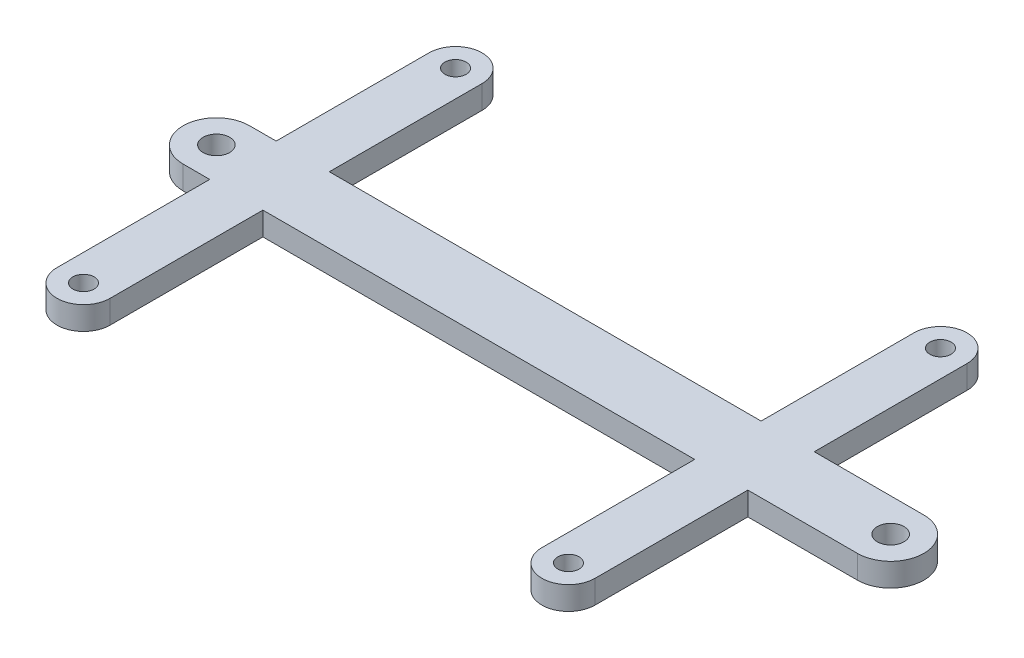
ISO-10303-21;
HEADER;
FILE_DESCRIPTION(('STEP AP214'),'2;1');
FILE_NAME('part.step','',(''),(''),'','','');
FILE_SCHEMA(('AUTOMOTIVE_DESIGN { 1 0 10303 214 1 1 1 1 }'));
ENDSEC;
DATA;
#1=APPLICATION_CONTEXT('core data for automotive mechanical design processes');
#2=APPLICATION_PROTOCOL_DEFINITION('international standard','automotive_design',2000,#1);
#3=PRODUCT_CONTEXT('',#1,'mechanical');
#4=PRODUCT('Part','Part','',(#3));
#5=PRODUCT_RELATED_PRODUCT_CATEGORY('part','',(#4));
#6=PRODUCT_DEFINITION_FORMATION('','',#4);
#7=PRODUCT_DEFINITION_CONTEXT('part definition',#1,'design');
#8=PRODUCT_DEFINITION('design','',#6,#7);
#9=PRODUCT_DEFINITION_SHAPE('','',#8);
#10=(LENGTH_UNIT() NAMED_UNIT(*) SI_UNIT(.MILLI.,.METRE.));
#11=(NAMED_UNIT(*) PLANE_ANGLE_UNIT() SI_UNIT($,.RADIAN.));
#12=(NAMED_UNIT(*) SI_UNIT($,.STERADIAN.) SOLID_ANGLE_UNIT());
#13=UNCERTAINTY_MEASURE_WITH_UNIT(LENGTH_MEASURE(1.E-05),#10,'distance_accuracy_value','');
#14=(GEOMETRIC_REPRESENTATION_CONTEXT(3) GLOBAL_UNCERTAINTY_ASSIGNED_CONTEXT((#13)) GLOBAL_UNIT_ASSIGNED_CONTEXT((#10,
#11,#12)) REPRESENTATION_CONTEXT('',''));
#15=CARTESIAN_POINT('',(0.,0.,0.));
#16=DIRECTION('',(0.,0.,1.));
#17=DIRECTION('',(1.,0.,0.));
#18=AXIS2_PLACEMENT_3D('',#15,#16,#17);
#19=CARTESIAN_POINT('',(29.5,3.5,27.9999999999974));
#20=DIRECTION('',(0.,-1.,0.));
#21=DIRECTION('',(0.,0.,-1.));
#22=AXIS2_PLACEMENT_3D('',#19,#20,#21);
#23=CYLINDRICAL_SURFACE('',#22,4.);
#24=CARTESIAN_POINT('',(29.5,0.,27.9999999999974));
#25=DIRECTION('',(0.,1.,0.));
#26=DIRECTION('',(0.,0.,1.));
#27=AXIS2_PLACEMENT_3D('',#24,#25,#26);
#28=CIRCLE('',#27,4.);
#29=CARTESIAN_POINT('',(33.5,0.,27.9999999999974));
#30=VERTEX_POINT('',#29);
#31=CARTESIAN_POINT('',(25.5,0.,27.9999999999974));
#32=VERTEX_POINT('',#31);
#33=EDGE_CURVE('E249',#30,#32,#28,.F.);
#34=ORIENTED_EDGE('',*,*,#33,.F.);
#35=DIRECTION('',(0.,-1.,0.));
#36=VECTOR('',#35,1.);
#37=CARTESIAN_POINT('',(33.5,3.5,27.9999999999974));
#38=LINE('',#37,#36);
#39=CARTESIAN_POINT('',(33.5,3.5,27.9999999999974));
#40=VERTEX_POINT('',#39);
#41=EDGE_CURVE('E11',#40,#30,#38,.T.);
#42=ORIENTED_EDGE('',*,*,#41,.F.);
#43=CARTESIAN_POINT('',(29.5,3.5,27.9999999999974));
#44=DIRECTION('',(0.,1.,0.));
#45=DIRECTION('',(0.,0.,1.));
#46=AXIS2_PLACEMENT_3D('',#43,#44,#45);
#47=CIRCLE('',#46,4.);
#48=CARTESIAN_POINT('',(25.5,3.5,27.9999999999974));
#49=VERTEX_POINT('',#48);
#50=EDGE_CURVE('E615',#40,#49,#47,.F.);
#51=ORIENTED_EDGE('',*,*,#50,.T.);
#52=DIRECTION('',(0.,-1.,0.));
#53=VECTOR('',#52,1.);
#54=CARTESIAN_POINT('',(25.5,3.5,27.9999999999974));
#55=LINE('',#54,#53);
#56=EDGE_CURVE('E52',#49,#32,#55,.T.);
#57=ORIENTED_EDGE('',*,*,#56,.T.);
#58=EDGE_LOOP('',(#34,#42,#51,#57));
#59=FACE_BOUND('',#58,.T.);
#60=ADVANCED_FACE('F35',(#59),#23,.T.);
#61=CARTESIAN_POINT('',(33.5,3.5,0.));
#62=DIRECTION('',(-1.,0.,0.));
#63=DIRECTION('',(0.,0.,1.));
#64=AXIS2_PLACEMENT_3D('',#61,#62,#63);
#65=PLANE('',#64);
#66=DIRECTION('',(0.,0.,-1.));
#67=VECTOR('',#66,1.);
#68=CARTESIAN_POINT('',(33.5,0.,0.));
#69=LINE('',#68,#67);
#70=CARTESIAN_POINT('',(33.5,0.,5.00000000000078));
#71=VERTEX_POINT('',#70);
#72=EDGE_CURVE('E246',#30,#71,#69,.T.);
#73=ORIENTED_EDGE('',*,*,#72,.T.);
#74=DIRECTION('',(0.,-1.,0.));
#75=VECTOR('',#74,1.);
#76=CARTESIAN_POINT('',(33.5,3.5,5.00000000000078));
#77=LINE('',#76,#75);
#78=CARTESIAN_POINT('',(33.5,3.5,5.00000000000078));
#79=VERTEX_POINT('',#78);
#80=EDGE_CURVE('E44',#79,#71,#77,.T.);
#81=ORIENTED_EDGE('',*,*,#80,.F.);
#82=DIRECTION('',(0.,0.,-1.));
#83=VECTOR('',#82,1.);
#84=CARTESIAN_POINT('',(33.5,3.5,0.));
#85=LINE('',#84,#83);
#86=EDGE_CURVE('E613',#40,#79,#85,.T.);
#87=ORIENTED_EDGE('',*,*,#86,.F.);
#88=ORIENTED_EDGE('',*,*,#41,.T.);
#89=EDGE_LOOP('',(#73,#81,#87,#88));
#90=FACE_BOUND('',#89,.T.);
#91=ADVANCED_FACE('F247',(#90),#65,.F.);
#92=CARTESIAN_POINT('',(2.39181570172674E-13,3.5,5.00000000000238));
#93=DIRECTION('',(0.,0.,1.));
#94=DIRECTION('',(1.,0.,0.));
#95=AXIS2_PLACEMENT_3D('',#92,#93,#94);
#96=PLANE('',#95);
#97=DIRECTION('',(-1.,0.,0.));
#98=VECTOR('',#97,1.);
#99=CARTESIAN_POINT('',(2.39181570172674E-13,0.,5.00000000000238));
#100=LINE('',#99,#98);
#101=CARTESIAN_POINT('',(50.,0.,4.99999999999999));
#102=VERTEX_POINT('',#101);
#103=EDGE_CURVE('E241',#102,#71,#100,.T.);
#104=ORIENTED_EDGE('',*,*,#103,.F.);
#105=DIRECTION('',(0.,-1.,0.));
#106=VECTOR('',#105,1.);
#107=CARTESIAN_POINT('',(50.,3.5,4.99999999999999));
#108=LINE('',#107,#106);
#109=CARTESIAN_POINT('',(50.,3.5,4.99999999999999));
#110=VERTEX_POINT('',#109);
#111=EDGE_CURVE('E233',#110,#102,#108,.T.);
#112=ORIENTED_EDGE('',*,*,#111,.F.);
#113=DIRECTION('',(-1.,0.,0.));
#114=VECTOR('',#113,1.);
#115=CARTESIAN_POINT('',(2.39181570172674E-13,3.5,5.00000000000238));
#116=LINE('',#115,#114);
#117=EDGE_CURVE('E243',#110,#79,#116,.T.);
#118=ORIENTED_EDGE('',*,*,#117,.T.);
#119=ORIENTED_EDGE('',*,*,#80,.T.);
#120=EDGE_LOOP('',(#104,#112,#118,#119));
#121=FACE_BOUND('',#120,.T.);
#122=ADVANCED_FACE('F239',(#121),#96,.T.);
#123=CARTESIAN_POINT('',(50.,3.5,0.));
#124=DIRECTION('',(0.,-1.,0.));
#125=DIRECTION('',(0.,0.,-1.));
#126=AXIS2_PLACEMENT_3D('',#123,#124,#125);
#127=CYLINDRICAL_SURFACE('',#126,4.99999999999999);
#128=CARTESIAN_POINT('',(50.,0.,0.));
#129=DIRECTION('',(0.,1.,0.));
#130=DIRECTION('',(0.,0.,1.));
#131=AXIS2_PLACEMENT_3D('',#128,#129,#130);
#132=CIRCLE('',#131,4.99999999999999);
#133=CARTESIAN_POINT('',(50.,0.,-4.99999999999999));
#134=VERTEX_POINT('',#133);
#135=EDGE_CURVE('E255',#102,#134,#132,.T.);
#136=ORIENTED_EDGE('',*,*,#135,.T.);
#137=DIRECTION('',(0.,-1.,0.));
#138=VECTOR('',#137,1.);
#139=CARTESIAN_POINT('',(50.,3.5,-4.99999999999999));
#140=LINE('',#139,#138);
#141=CARTESIAN_POINT('',(50.,3.5,-4.99999999999999));
#142=VERTEX_POINT('',#141);
#143=EDGE_CURVE('E230',#142,#134,#140,.T.);
#144=ORIENTED_EDGE('',*,*,#143,.F.);
#145=CARTESIAN_POINT('',(50.,3.5,0.));
#146=DIRECTION('',(0.,1.,0.));
#147=DIRECTION('',(0.,0.,1.));
#148=AXIS2_PLACEMENT_3D('',#145,#146,#147);
#149=CIRCLE('',#148,4.99999999999999);
#150=EDGE_CURVE('E610',#110,#142,#149,.T.);
#151=ORIENTED_EDGE('',*,*,#150,.F.);
#152=ORIENTED_EDGE('',*,*,#111,.T.);
#153=EDGE_LOOP('',(#136,#144,#151,#152));
#154=FACE_BOUND('',#153,.T.);
#155=ADVANCED_FACE('F563',(#154),#127,.T.);
#156=CARTESIAN_POINT('',(2.39181570172674E-13,3.5,-5.00000000000238));
#157=DIRECTION('',(0.,0.,1.));
#158=DIRECTION('',(1.,0.,0.));
#159=AXIS2_PLACEMENT_3D('',#156,#157,#158);
#160=PLANE('',#159);
#161=DIRECTION('',(-1.,0.,0.));
#162=VECTOR('',#161,1.);
#163=CARTESIAN_POINT('',(2.39181570172674E-13,0.,-5.00000000000238));
#164=LINE('',#163,#162);
#165=CARTESIAN_POINT('',(33.5,0.,-5.00000000000078));
#166=VERTEX_POINT('',#165);
#167=EDGE_CURVE('E257',#134,#166,#164,.T.);
#168=ORIENTED_EDGE('',*,*,#167,.T.);
#169=DIRECTION('',(0.,-1.,0.));
#170=VECTOR('',#169,1.);
#171=CARTESIAN_POINT('',(33.5,3.5,-5.00000000000078));
#172=LINE('',#171,#170);
#173=CARTESIAN_POINT('',(33.5,3.5,-5.00000000000078));
#174=VERTEX_POINT('',#173);
#175=EDGE_CURVE('E228',#174,#166,#172,.T.);
#176=ORIENTED_EDGE('',*,*,#175,.F.);
#177=DIRECTION('',(-1.,0.,0.));
#178=VECTOR('',#177,1.);
#179=CARTESIAN_POINT('',(2.39181570172674E-13,3.5,-5.00000000000238));
#180=LINE('',#179,#178);
#181=EDGE_CURVE('E611',#142,#174,#180,.T.);
#182=ORIENTED_EDGE('',*,*,#181,.F.);
#183=ORIENTED_EDGE('',*,*,#143,.T.);
#184=EDGE_LOOP('',(#168,#176,#182,#183));
#185=FACE_BOUND('',#184,.T.);
#186=ADVANCED_FACE('F554',(#185),#160,.F.);
#187=CARTESIAN_POINT('',(33.5,3.5,0.));
#188=DIRECTION('',(1.,0.,0.));
#189=DIRECTION('',(0.,0.,-1.));
#190=AXIS2_PLACEMENT_3D('',#187,#188,#189);
#191=PLANE('',#190);
#192=DIRECTION('',(0.,0.,1.));
#193=VECTOR('',#192,1.);
#194=CARTESIAN_POINT('',(33.5,0.,0.));
#195=LINE('',#194,#193);
#196=CARTESIAN_POINT('',(33.5,0.,-27.9999999999974));
#197=VERTEX_POINT('',#196);
#198=EDGE_CURVE('E263',#197,#166,#195,.T.);
#199=ORIENTED_EDGE('',*,*,#198,.F.);
#200=DIRECTION('',(0.,-1.,0.));
#201=VECTOR('',#200,1.);
#202=CARTESIAN_POINT('',(33.5,3.5,-27.9999999999974));
#203=LINE('',#202,#201);
#204=CARTESIAN_POINT('',(33.5,3.5,-27.9999999999974));
#205=VERTEX_POINT('',#204);
#206=EDGE_CURVE('E226',#205,#197,#203,.T.);
#207=ORIENTED_EDGE('',*,*,#206,.F.);
#208=DIRECTION('',(0.,0.,1.));
#209=VECTOR('',#208,1.);
#210=CARTESIAN_POINT('',(33.5,3.5,0.));
#211=LINE('',#210,#209);
#212=EDGE_CURVE('E620',#205,#174,#211,.T.);
#213=ORIENTED_EDGE('',*,*,#212,.T.);
#214=ORIENTED_EDGE('',*,*,#175,.T.);
#215=EDGE_LOOP('',(#199,#207,#213,#214));
#216=FACE_BOUND('',#215,.T.);
#217=ADVANCED_FACE('F545',(#216),#191,.T.);
#218=CARTESIAN_POINT('',(29.5,3.5,-27.9999999999974));
#219=DIRECTION('',(0.,-1.,0.));
#220=DIRECTION('',(0.,0.,-1.));
#221=AXIS2_PLACEMENT_3D('',#218,#219,#220);
#222=CYLINDRICAL_SURFACE('',#221,4.);
#223=CARTESIAN_POINT('',(29.5,0.,-27.9999999999974));
#224=DIRECTION('',(0.,1.,0.));
#225=DIRECTION('',(0.,0.,1.));
#226=AXIS2_PLACEMENT_3D('',#223,#224,#225);
#227=CIRCLE('',#226,4.);
#228=CARTESIAN_POINT('',(25.5,0.,-27.9999999999974));
#229=VERTEX_POINT('',#228);
#230=EDGE_CURVE('E266',#197,#229,#227,.T.);
#231=ORIENTED_EDGE('',*,*,#230,.T.);
#232=DIRECTION('',(0.,-1.,0.));
#233=VECTOR('',#232,1.);
#234=CARTESIAN_POINT('',(25.5,3.5,-27.9999999999974));
#235=LINE('',#234,#233);
#236=CARTESIAN_POINT('',(25.5,3.5,-27.9999999999974));
#237=VERTEX_POINT('',#236);
#238=EDGE_CURVE('E223',#237,#229,#235,.T.);
#239=ORIENTED_EDGE('',*,*,#238,.F.);
#240=CARTESIAN_POINT('',(29.5,3.5,-27.9999999999974));
#241=DIRECTION('',(0.,1.,0.));
#242=DIRECTION('',(0.,0.,1.));
#243=AXIS2_PLACEMENT_3D('',#240,#241,#242);
#244=CIRCLE('',#243,4.);
#245=EDGE_CURVE('E623',#205,#237,#244,.T.);
#246=ORIENTED_EDGE('',*,*,#245,.F.);
#247=ORIENTED_EDGE('',*,*,#206,.T.);
#248=EDGE_LOOP('',(#231,#239,#246,#247));
#249=FACE_BOUND('',#248,.T.);
#250=ADVANCED_FACE('F536',(#249),#222,.T.);
#251=CARTESIAN_POINT('',(25.5,3.5,0.));
#252=DIRECTION('',(1.,0.,0.));
#253=DIRECTION('',(0.,0.,-1.));
#254=AXIS2_PLACEMENT_3D('',#251,#252,#253);
#255=PLANE('',#254);
#256=DIRECTION('',(0.,0.,1.));
#257=VECTOR('',#256,1.);
#258=CARTESIAN_POINT('',(25.5,0.,0.));
#259=LINE('',#258,#257);
#260=CARTESIAN_POINT('',(25.5,0.,-5.00000000000077));
#261=VERTEX_POINT('',#260);
#262=EDGE_CURVE('E269',#229,#261,#259,.T.);
#263=ORIENTED_EDGE('',*,*,#262,.T.);
#264=DIRECTION('',(0.,-1.,0.));
#265=VECTOR('',#264,1.);
#266=CARTESIAN_POINT('',(25.5,3.5,-5.00000000000077));
#267=LINE('',#266,#265);
#268=CARTESIAN_POINT('',(25.5,3.5,-5.00000000000077));
#269=VERTEX_POINT('',#268);
#270=EDGE_CURVE('E221',#269,#261,#267,.T.);
#271=ORIENTED_EDGE('',*,*,#270,.F.);
#272=DIRECTION('',(0.,0.,1.));
#273=VECTOR('',#272,1.);
#274=CARTESIAN_POINT('',(25.5,3.5,0.));
#275=LINE('',#274,#273);
#276=EDGE_CURVE('E626',#237,#269,#275,.T.);
#277=ORIENTED_EDGE('',*,*,#276,.F.);
#278=ORIENTED_EDGE('',*,*,#238,.T.);
#279=EDGE_LOOP('',(#263,#271,#277,#278));
#280=FACE_BOUND('',#279,.T.);
#281=ADVANCED_FACE('F527',(#280),#255,.F.);
#282=CARTESIAN_POINT('',(0.,3.5,-5.00000000000077));
#283=DIRECTION('',(0.,0.,-1.));
#284=DIRECTION('',(-1.,0.,0.));
#285=AXIS2_PLACEMENT_3D('',#282,#283,#284);
#286=PLANE('',#285);
#287=DIRECTION('',(1.,0.,0.));
#288=VECTOR('',#287,1.);
#289=CARTESIAN_POINT('',(0.,0.,-5.00000000000077));
#290=LINE('',#289,#288);
#291=CARTESIAN_POINT('',(-39.4999999999989,0.,-5.00000000000078));
#292=VERTEX_POINT('',#291);
#293=EDGE_CURVE('E272',#292,#261,#290,.T.);
#294=ORIENTED_EDGE('',*,*,#293,.F.);
#295=DIRECTION('',(0.,-1.,0.));
#296=VECTOR('',#295,1.);
#297=CARTESIAN_POINT('',(-39.4999999999989,3.5,-5.00000000000078));
#298=LINE('',#297,#296);
#299=CARTESIAN_POINT('',(-39.4999999999989,3.5,-5.00000000000078));
#300=VERTEX_POINT('',#299);
#301=EDGE_CURVE('E219',#300,#292,#298,.T.);
#302=ORIENTED_EDGE('',*,*,#301,.F.);
#303=DIRECTION('',(1.,0.,0.));
#304=VECTOR('',#303,1.);
#305=CARTESIAN_POINT('',(0.,3.5,-5.00000000000077));
#306=LINE('',#305,#304);
#307=EDGE_CURVE('E628',#300,#269,#306,.T.);
#308=ORIENTED_EDGE('',*,*,#307,.T.);
#309=ORIENTED_EDGE('',*,*,#270,.T.);
#310=EDGE_LOOP('',(#294,#302,#308,#309));
#311=FACE_BOUND('',#310,.T.);
#312=ADVANCED_FACE('F518',(#311),#286,.T.);
#313=CARTESIAN_POINT('',(-39.4999999999989,3.5,0.));
#314=DIRECTION('',(1.,0.,0.));
#315=DIRECTION('',(0.,0.,-1.));
#316=AXIS2_PLACEMENT_3D('',#313,#314,#315);
#317=PLANE('',#316);
#318=DIRECTION('',(0.,0.,1.));
#319=VECTOR('',#318,1.);
#320=CARTESIAN_POINT('',(-39.4999999999989,0.,0.));
#321=LINE('',#320,#319);
#322=CARTESIAN_POINT('',(-39.4999999999989,0.,-28.0000000000003));
#323=VERTEX_POINT('',#322);
#324=EDGE_CURVE('E275',#323,#292,#321,.T.);
#325=ORIENTED_EDGE('',*,*,#324,.F.);
#326=DIRECTION('',(0.,-1.,0.));
#327=VECTOR('',#326,1.);
#328=CARTESIAN_POINT('',(-39.4999999999989,3.5,-28.0000000000003));
#329=LINE('',#328,#327);
#330=CARTESIAN_POINT('',(-39.4999999999989,3.5,-28.0000000000003));
#331=VERTEX_POINT('',#330);
#332=EDGE_CURVE('E217',#331,#323,#329,.T.);
#333=ORIENTED_EDGE('',*,*,#332,.F.);
#334=DIRECTION('',(0.,0.,1.));
#335=VECTOR('',#334,1.);
#336=CARTESIAN_POINT('',(-39.4999999999989,3.5,0.));
#337=LINE('',#336,#335);
#338=EDGE_CURVE('E631',#331,#300,#337,.T.);
#339=ORIENTED_EDGE('',*,*,#338,.T.);
#340=ORIENTED_EDGE('',*,*,#301,.T.);
#341=EDGE_LOOP('',(#325,#333,#339,#340));
#342=FACE_BOUND('',#341,.T.);
#343=ADVANCED_FACE('F509',(#342),#317,.T.);
#344=CARTESIAN_POINT('',(-43.4999999999989,3.5,-28.0000000000003));
#345=DIRECTION('',(0.,-1.,0.));
#346=DIRECTION('',(0.,0.,-1.));
#347=AXIS2_PLACEMENT_3D('',#344,#345,#346);
#348=CYLINDRICAL_SURFACE('',#347,4.);
#349=CARTESIAN_POINT('',(-43.4999999999989,0.,-28.0000000000003));
#350=DIRECTION('',(0.,1.,0.));
#351=DIRECTION('',(0.,0.,1.));
#352=AXIS2_PLACEMENT_3D('',#349,#350,#351);
#353=CIRCLE('',#352,4.);
#354=CARTESIAN_POINT('',(-47.4999999999989,0.,-28.0000000000003));
#355=VERTEX_POINT('',#354);
#356=EDGE_CURVE('E278',#323,#355,#353,.T.);
#357=ORIENTED_EDGE('',*,*,#356,.T.);
#358=DIRECTION('',(0.,-1.,0.));
#359=VECTOR('',#358,1.);
#360=CARTESIAN_POINT('',(-47.4999999999989,3.5,-28.0000000000003));
#361=LINE('',#360,#359);
#362=CARTESIAN_POINT('',(-47.4999999999989,3.5,-28.0000000000003));
#363=VERTEX_POINT('',#362);
#364=EDGE_CURVE('E214',#363,#355,#361,.T.);
#365=ORIENTED_EDGE('',*,*,#364,.F.);
#366=CARTESIAN_POINT('',(-43.4999999999989,3.5,-28.0000000000003));
#367=DIRECTION('',(0.,1.,0.));
#368=DIRECTION('',(0.,0.,1.));
#369=AXIS2_PLACEMENT_3D('',#366,#367,#368);
#370=CIRCLE('',#369,4.);
#371=EDGE_CURVE('E634',#331,#363,#370,.T.);
#372=ORIENTED_EDGE('',*,*,#371,.F.);
#373=ORIENTED_EDGE('',*,*,#332,.T.);
#374=EDGE_LOOP('',(#357,#365,#372,#373));
#375=FACE_BOUND('',#374,.T.);
#376=ADVANCED_FACE('F500',(#375),#348,.T.);
#377=CARTESIAN_POINT('',(-47.4999999999989,3.5,0.));
#378=DIRECTION('',(1.,0.,0.));
#379=DIRECTION('',(0.,0.,-1.));
#380=AXIS2_PLACEMENT_3D('',#377,#378,#379);
#381=PLANE('',#380);
#382=DIRECTION('',(0.,0.,1.));
#383=VECTOR('',#382,1.);
#384=CARTESIAN_POINT('',(-47.4999999999989,0.,0.));
#385=LINE('',#384,#383);
#386=CARTESIAN_POINT('',(-47.4999999999989,0.,-5.00000000000078));
#387=VERTEX_POINT('',#386);
#388=EDGE_CURVE('E281',#355,#387,#385,.T.);
#389=ORIENTED_EDGE('',*,*,#388,.T.);
#390=DIRECTION('',(0.,-1.,0.));
#391=VECTOR('',#390,1.);
#392=CARTESIAN_POINT('',(-47.4999999999989,3.5,-5.00000000000078));
#393=LINE('',#392,#391);
#394=CARTESIAN_POINT('',(-47.4999999999989,3.5,-5.00000000000078));
#395=VERTEX_POINT('',#394);
#396=EDGE_CURVE('E212',#395,#387,#393,.T.);
#397=ORIENTED_EDGE('',*,*,#396,.F.);
#398=DIRECTION('',(0.,0.,1.));
#399=VECTOR('',#398,1.);
#400=CARTESIAN_POINT('',(-47.4999999999989,3.5,0.));
#401=LINE('',#400,#399);
#402=EDGE_CURVE('E637',#363,#395,#401,.T.);
#403=ORIENTED_EDGE('',*,*,#402,.F.);
#404=ORIENTED_EDGE('',*,*,#364,.T.);
#405=EDGE_LOOP('',(#389,#397,#403,#404));
#406=FACE_BOUND('',#405,.T.);
#407=ADVANCED_FACE('F491',(#406),#381,.F.);
#408=CARTESIAN_POINT('',(0.,3.5,-5.00000000000078));
#409=DIRECTION('',(0.,0.,-1.));
#410=DIRECTION('',(-1.,0.,0.));
#411=AXIS2_PLACEMENT_3D('',#408,#409,#410);
#412=PLANE('',#411);
#413=DIRECTION('',(1.,0.,0.));
#414=VECTOR('',#413,1.);
#415=CARTESIAN_POINT('',(0.,0.,-5.00000000000078));
#416=LINE('',#415,#414);
#417=CARTESIAN_POINT('',(-51.4999999999989,0.,-5.00000000000078));
#418=VERTEX_POINT('',#417);
#419=EDGE_CURVE('E284',#418,#387,#416,.T.);
#420=ORIENTED_EDGE('',*,*,#419,.F.);
#421=DIRECTION('',(0.,-1.,0.));
#422=VECTOR('',#421,1.);
#423=CARTESIAN_POINT('',(-51.4999999999989,3.5,-5.00000000000078));
#424=LINE('',#423,#422);
#425=CARTESIAN_POINT('',(-51.4999999999989,3.5,-5.00000000000078));
#426=VERTEX_POINT('',#425);
#427=EDGE_CURVE('E210',#426,#418,#424,.T.);
#428=ORIENTED_EDGE('',*,*,#427,.F.);
#429=DIRECTION('',(1.,0.,0.));
#430=VECTOR('',#429,1.);
#431=CARTESIAN_POINT('',(0.,3.5,-5.00000000000078));
#432=LINE('',#431,#430);
#433=EDGE_CURVE('E639',#426,#395,#432,.T.);
#434=ORIENTED_EDGE('',*,*,#433,.T.);
#435=ORIENTED_EDGE('',*,*,#396,.T.);
#436=EDGE_LOOP('',(#420,#428,#434,#435));
#437=FACE_BOUND('',#436,.T.);
#438=ADVANCED_FACE('F482',(#437),#412,.T.);
#439=CARTESIAN_POINT('',(-51.4999999999989,3.5,0.));
#440=DIRECTION('',(0.,-1.,0.));
#441=DIRECTION('',(0.,0.,-1.));
#442=AXIS2_PLACEMENT_3D('',#439,#440,#441);
#443=CYLINDRICAL_SURFACE('',#442,5.00000000000078);
#444=CARTESIAN_POINT('',(-51.4999999999989,0.,0.));
#445=DIRECTION('',(0.,1.,0.));
#446=DIRECTION('',(0.,0.,1.));
#447=AXIS2_PLACEMENT_3D('',#444,#445,#446);
#448=CIRCLE('',#447,5.00000000000078);
#449=CARTESIAN_POINT('',(-51.4999999999989,0.,5.00000000000078));
#450=VERTEX_POINT('',#449);
#451=EDGE_CURVE('E287',#450,#418,#448,.F.);
#452=ORIENTED_EDGE('',*,*,#451,.F.);
#453=DIRECTION('',(0.,-1.,0.));
#454=VECTOR('',#453,1.);
#455=CARTESIAN_POINT('',(-51.4999999999989,3.5,5.00000000000078));
#456=LINE('',#455,#454);
#457=CARTESIAN_POINT('',(-51.4999999999989,3.5,5.00000000000078));
#458=VERTEX_POINT('',#457);
#459=EDGE_CURVE('E208',#458,#450,#456,.T.);
#460=ORIENTED_EDGE('',*,*,#459,.F.);
#461=CARTESIAN_POINT('',(-51.4999999999989,3.5,0.));
#462=DIRECTION('',(0.,1.,0.));
#463=DIRECTION('',(0.,0.,1.));
#464=AXIS2_PLACEMENT_3D('',#461,#462,#463);
#465=CIRCLE('',#464,5.00000000000078);
#466=EDGE_CURVE('E642',#458,#426,#465,.F.);
#467=ORIENTED_EDGE('',*,*,#466,.T.);
#468=ORIENTED_EDGE('',*,*,#427,.T.);
#469=EDGE_LOOP('',(#452,#460,#467,#468));
#470=FACE_BOUND('',#469,.T.);
#471=ADVANCED_FACE('F473',(#470),#443,.T.);
#472=CARTESIAN_POINT('',(0.,3.5,5.00000000000078));
#473=DIRECTION('',(0.,0.,1.));
#474=DIRECTION('',(1.,0.,0.));
#475=AXIS2_PLACEMENT_3D('',#472,#473,#474);
#476=PLANE('',#475);
#477=DIRECTION('',(-1.,0.,0.));
#478=VECTOR('',#477,1.);
#479=CARTESIAN_POINT('',(0.,0.,5.00000000000078));
#480=LINE('',#479,#478);
#481=CARTESIAN_POINT('',(-47.4999999999989,0.,5.00000000000078));
#482=VERTEX_POINT('',#481);
#483=EDGE_CURVE('E290',#482,#450,#480,.T.);
#484=ORIENTED_EDGE('',*,*,#483,.F.);
#485=DIRECTION('',(0.,-1.,0.));
#486=VECTOR('',#485,1.);
#487=CARTESIAN_POINT('',(-47.4999999999989,3.5,5.00000000000078));
#488=LINE('',#487,#486);
#489=CARTESIAN_POINT('',(-47.4999999999989,3.5,5.00000000000078));
#490=VERTEX_POINT('',#489);
#491=EDGE_CURVE('E206',#490,#482,#488,.T.);
#492=ORIENTED_EDGE('',*,*,#491,.F.);
#493=DIRECTION('',(-1.,0.,0.));
#494=VECTOR('',#493,1.);
#495=CARTESIAN_POINT('',(0.,3.5,5.00000000000078));
#496=LINE('',#495,#494);
#497=EDGE_CURVE('E645',#490,#458,#496,.T.);
#498=ORIENTED_EDGE('',*,*,#497,.T.);
#499=ORIENTED_EDGE('',*,*,#459,.T.);
#500=EDGE_LOOP('',(#484,#492,#498,#499));
#501=FACE_BOUND('',#500,.T.);
#502=ADVANCED_FACE('F464',(#501),#476,.T.);
#503=CARTESIAN_POINT('',(-47.4999999999989,3.5,0.));
#504=DIRECTION('',(-1.,0.,0.));
#505=DIRECTION('',(0.,0.,1.));
#506=AXIS2_PLACEMENT_3D('',#503,#504,#505);
#507=PLANE('',#506);
#508=DIRECTION('',(0.,0.,-1.));
#509=VECTOR('',#508,1.);
#510=CARTESIAN_POINT('',(-47.4999999999989,0.,0.));
#511=LINE('',#510,#509);
#512=CARTESIAN_POINT('',(-47.4999999999989,0.,28.0000000000003));
#513=VERTEX_POINT('',#512);
#514=EDGE_CURVE('E293',#513,#482,#511,.T.);
#515=ORIENTED_EDGE('',*,*,#514,.F.);
#516=DIRECTION('',(0.,-1.,0.));
#517=VECTOR('',#516,1.);
#518=CARTESIAN_POINT('',(-47.4999999999989,3.5,28.0000000000003));
#519=LINE('',#518,#517);
#520=CARTESIAN_POINT('',(-47.4999999999989,3.5,28.0000000000003));
#521=VERTEX_POINT('',#520);
#522=EDGE_CURVE('E200',#521,#513,#519,.T.);
#523=ORIENTED_EDGE('',*,*,#522,.F.);
#524=DIRECTION('',(0.,0.,-1.));
#525=VECTOR('',#524,1.);
#526=CARTESIAN_POINT('',(-47.4999999999989,3.5,0.));
#527=LINE('',#526,#525);
#528=EDGE_CURVE('E648',#521,#490,#527,.T.);
#529=ORIENTED_EDGE('',*,*,#528,.T.);
#530=ORIENTED_EDGE('',*,*,#491,.T.);
#531=EDGE_LOOP('',(#515,#523,#529,#530));
#532=FACE_BOUND('',#531,.T.);
#533=ADVANCED_FACE('F455',(#532),#507,.T.);
#534=CARTESIAN_POINT('',(-43.4999999999989,3.5,28.0000000000003));
#535=DIRECTION('',(0.,-1.,0.));
#536=DIRECTION('',(0.,0.,-1.));
#537=AXIS2_PLACEMENT_3D('',#534,#535,#536);
#538=CYLINDRICAL_SURFACE('',#537,4.);
#539=CARTESIAN_POINT('',(-43.4999999999989,0.,28.0000000000003));
#540=DIRECTION('',(0.,1.,0.));
#541=DIRECTION('',(0.,0.,1.));
#542=AXIS2_PLACEMENT_3D('',#539,#540,#541);
#543=CIRCLE('',#542,4.);
#544=CARTESIAN_POINT('',(-39.4999999999989,0.,28.0000000000003));
#545=VERTEX_POINT('',#544);
#546=EDGE_CURVE('E296',#545,#513,#543,.F.);
#547=ORIENTED_EDGE('',*,*,#546,.F.);
#548=DIRECTION('',(0.,-1.,0.));
#549=VECTOR('',#548,1.);
#550=CARTESIAN_POINT('',(-39.4999999999989,3.5,28.0000000000003));
#551=LINE('',#550,#549);
#552=CARTESIAN_POINT('',(-39.4999999999989,3.5,28.0000000000003));
#553=VERTEX_POINT('',#552);
#554=EDGE_CURVE('E198',#553,#545,#551,.T.);
#555=ORIENTED_EDGE('',*,*,#554,.F.);
#556=CARTESIAN_POINT('',(-43.4999999999989,3.5,28.0000000000003));
#557=DIRECTION('',(0.,1.,0.));
#558=DIRECTION('',(0.,0.,1.));
#559=AXIS2_PLACEMENT_3D('',#556,#557,#558);
#560=CIRCLE('',#559,4.);
#561=EDGE_CURVE('E192',#553,#521,#560,.F.);
#562=ORIENTED_EDGE('',*,*,#561,.T.);
#563=ORIENTED_EDGE('',*,*,#522,.T.);
#564=EDGE_LOOP('',(#547,#555,#562,#563));
#565=FACE_BOUND('',#564,.T.);
#566=ADVANCED_FACE('F447',(#565),#538,.T.);
#567=CARTESIAN_POINT('',(-39.4999999999989,3.5,0.));
#568=DIRECTION('',(-1.,0.,0.));
#569=DIRECTION('',(0.,0.,1.));
#570=AXIS2_PLACEMENT_3D('',#567,#568,#569);
#571=PLANE('',#570);
#572=DIRECTION('',(0.,0.,-1.));
#573=VECTOR('',#572,1.);
#574=CARTESIAN_POINT('',(-39.4999999999989,0.,0.));
#575=LINE('',#574,#573);
#576=CARTESIAN_POINT('',(-39.4999999999989,0.,5.00000000000078));
#577=VERTEX_POINT('',#576);
#578=EDGE_CURVE('E197',#545,#577,#575,.T.);
#579=ORIENTED_EDGE('',*,*,#578,.T.);
#580=DIRECTION('',(0.,-1.,0.));
#581=VECTOR('',#580,1.);
#582=CARTESIAN_POINT('',(-39.4999999999989,3.5,5.00000000000078));
#583=LINE('',#582,#581);
#584=CARTESIAN_POINT('',(-39.4999999999989,3.5,5.00000000000078));
#585=VERTEX_POINT('',#584);
#586=EDGE_CURVE('E178',#585,#577,#583,.T.);
#587=ORIENTED_EDGE('',*,*,#586,.F.);
#588=DIRECTION('',(0.,0.,-1.));
#589=VECTOR('',#588,1.);
#590=CARTESIAN_POINT('',(-39.4999999999989,3.5,0.));
#591=LINE('',#590,#589);
#592=EDGE_CURVE('E183',#553,#585,#591,.T.);
#593=ORIENTED_EDGE('',*,*,#592,.F.);
#594=ORIENTED_EDGE('',*,*,#554,.T.);
#595=EDGE_LOOP('',(#579,#587,#593,#594));
#596=FACE_BOUND('',#595,.T.);
#597=ADVANCED_FACE('F195',(#596),#571,.F.);
#598=CARTESIAN_POINT('',(0.,3.5,5.00000000000077));
#599=DIRECTION('',(0.,0.,-1.));
#600=DIRECTION('',(-1.,0.,0.));
#601=AXIS2_PLACEMENT_3D('',#598,#599,#600);
#602=PLANE('',#601);
#603=DIRECTION('',(1.,0.,0.));
#604=VECTOR('',#603,1.);
#605=CARTESIAN_POINT('',(0.,0.,5.00000000000077));
#606=LINE('',#605,#604);
#607=CARTESIAN_POINT('',(25.5,0.,5.00000000000077));
#608=VERTEX_POINT('',#607);
#609=EDGE_CURVE('E300',#577,#608,#606,.T.);
#610=ORIENTED_EDGE('',*,*,#609,.T.);
#611=DIRECTION('',(0.,-1.,0.));
#612=VECTOR('',#611,1.);
#613=CARTESIAN_POINT('',(25.5,3.5,5.00000000000077));
#614=LINE('',#613,#612);
#615=CARTESIAN_POINT('',(25.5,3.5,5.00000000000077));
#616=VERTEX_POINT('',#615);
#617=EDGE_CURVE('E114',#616,#608,#614,.T.);
#618=ORIENTED_EDGE('',*,*,#617,.F.);
#619=DIRECTION('',(1.,0.,0.));
#620=VECTOR('',#619,1.);
#621=CARTESIAN_POINT('',(0.,3.5,5.00000000000077));
#622=LINE('',#621,#620);
#623=EDGE_CURVE('E174',#585,#616,#622,.T.);
#624=ORIENTED_EDGE('',*,*,#623,.F.);
#625=ORIENTED_EDGE('',*,*,#586,.T.);
#626=EDGE_LOOP('',(#610,#618,#624,#625));
#627=FACE_BOUND('',#626,.T.);
#628=ADVANCED_FACE('F176',(#627),#602,.F.);
#629=CARTESIAN_POINT('',(25.5,3.5,0.));
#630=DIRECTION('',(-1.,0.,0.));
#631=DIRECTION('',(0.,0.,1.));
#632=AXIS2_PLACEMENT_3D('',#629,#630,#631);
#633=PLANE('',#632);
#634=DIRECTION('',(0.,0.,-1.));
#635=VECTOR('',#634,1.);
#636=CARTESIAN_POINT('',(25.5,0.,0.));
#637=LINE('',#636,#635);
#638=EDGE_CURVE('E302',#32,#608,#637,.T.);
#639=ORIENTED_EDGE('',*,*,#638,.F.);
#640=ORIENTED_EDGE('',*,*,#56,.F.);
#641=DIRECTION('',(0.,0.,-1.));
#642=VECTOR('',#641,1.);
#643=CARTESIAN_POINT('',(25.5,3.5,0.));
#644=LINE('',#643,#642);
#645=EDGE_CURVE('E182',#49,#616,#644,.T.);
#646=ORIENTED_EDGE('',*,*,#645,.T.);
#647=ORIENTED_EDGE('',*,*,#617,.T.);
#648=EDGE_LOOP('',(#639,#640,#646,#647));
#649=FACE_BOUND('',#648,.T.);
#650=ADVANCED_FACE('F328',(#649),#633,.T.);
#651=CARTESIAN_POINT('',(-51.4999999999989,3.5,0.));
#652=DIRECTION('',(0.,-1.,0.));
#653=DIRECTION('',(0.,0.,-1.));
#654=AXIS2_PLACEMENT_3D('',#651,#652,#653);
#655=CYLINDRICAL_SURFACE('',#654,2.00000000000087);
#656=CARTESIAN_POINT('',(-51.4999999999989,3.5,0.));
#657=DIRECTION('',(0.,1.,0.));
#658=DIRECTION('',(0.,0.,1.));
#659=AXIS2_PLACEMENT_3D('',#656,#657,#658);
#660=CIRCLE('',#659,2.00000000000087);
#661=CARTESIAN_POINT('',(-51.4999999999989,3.5,2.00000000000087));
#662=VERTEX_POINT('',#661);
#663=EDGE_CURVE('E675',#662,#662,#660,.F.);
#664=ORIENTED_EDGE('',*,*,#663,.F.);
#665=EDGE_LOOP('',(#664));
#666=FACE_BOUND('',#665,.T.);
#667=CARTESIAN_POINT('',(-51.4999999999989,0.,0.));
#668=DIRECTION('',(0.,1.,0.));
#669=DIRECTION('',(0.,0.,1.));
#670=AXIS2_PLACEMENT_3D('',#667,#668,#669);
#671=CIRCLE('',#670,2.00000000000087);
#672=CARTESIAN_POINT('',(-51.4999999999989,0.,2.00000000000087));
#673=VERTEX_POINT('',#672);
#674=EDGE_CURVE('E326',#673,#673,#671,.F.);
#675=ORIENTED_EDGE('',*,*,#674,.T.);
#676=EDGE_LOOP('',(#675));
#677=FACE_BOUND('',#676,.T.);
#678=ADVANCED_FACE('F330',(#666,#677),#655,.F.);
#679=CARTESIAN_POINT('',(50.,3.5,0.));
#680=DIRECTION('',(0.,-1.,0.));
#681=DIRECTION('',(0.,0.,-1.));
#682=AXIS2_PLACEMENT_3D('',#679,#680,#681);
#683=CYLINDRICAL_SURFACE('',#682,2.);
#684=CARTESIAN_POINT('',(50.,3.5,0.));
#685=DIRECTION('',(0.,1.,0.));
#686=DIRECTION('',(0.,0.,1.));
#687=AXIS2_PLACEMENT_3D('',#684,#685,#686);
#688=CIRCLE('',#687,2.);
#689=CARTESIAN_POINT('',(50.,3.5,2.));
#690=VERTEX_POINT('',#689);
#691=EDGE_CURVE('E678',#690,#690,#688,.T.);
#692=ORIENTED_EDGE('',*,*,#691,.T.);
#693=EDGE_LOOP('',(#692));
#694=FACE_BOUND('',#693,.T.);
#695=CARTESIAN_POINT('',(50.,0.,0.));
#696=DIRECTION('',(0.,1.,0.));
#697=DIRECTION('',(0.,0.,1.));
#698=AXIS2_PLACEMENT_3D('',#695,#696,#697);
#699=CIRCLE('',#698,2.);
#700=CARTESIAN_POINT('',(50.,0.,2.));
#701=VERTEX_POINT('',#700);
#702=EDGE_CURVE('E323',#701,#701,#699,.T.);
#703=ORIENTED_EDGE('',*,*,#702,.F.);
#704=EDGE_LOOP('',(#703));
#705=FACE_BOUND('',#704,.T.);
#706=ADVANCED_FACE('F336',(#694,#705),#683,.F.);
#707=CARTESIAN_POINT('',(29.5,3.5,-27.9999999999974));
#708=DIRECTION('',(0.,-1.,0.));
#709=DIRECTION('',(0.,0.,-1.));
#710=AXIS2_PLACEMENT_3D('',#707,#708,#709);
#711=CYLINDRICAL_SURFACE('',#710,1.59999999999925);
#712=CARTESIAN_POINT('',(29.5,3.5,-27.9999999999974));
#713=DIRECTION('',(0.,1.,0.));
#714=DIRECTION('',(0.,0.,1.));
#715=AXIS2_PLACEMENT_3D('',#712,#713,#714);
#716=CIRCLE('',#715,1.59999999999925);
#717=CARTESIAN_POINT('',(29.5,3.5,-26.3999999999981));
#718=VERTEX_POINT('',#717);
#719=EDGE_CURVE('E681',#718,#718,#716,.T.);
#720=ORIENTED_EDGE('',*,*,#719,.T.);
#721=EDGE_LOOP('',(#720));
#722=FACE_BOUND('',#721,.T.);
#723=CARTESIAN_POINT('',(29.5,0.,-27.9999999999974));
#724=DIRECTION('',(0.,1.,0.));
#725=DIRECTION('',(0.,0.,1.));
#726=AXIS2_PLACEMENT_3D('',#723,#724,#725);
#727=CIRCLE('',#726,1.59999999999925);
#728=CARTESIAN_POINT('',(29.5,0.,-26.3999999999981));
#729=VERTEX_POINT('',#728);
#730=EDGE_CURVE('E320',#729,#729,#727,.T.);
#731=ORIENTED_EDGE('',*,*,#730,.F.);
#732=EDGE_LOOP('',(#731));
#733=FACE_BOUND('',#732,.T.);
#734=ADVANCED_FACE('F351',(#722,#733),#711,.F.);
#735=CARTESIAN_POINT('',(-43.4999999999989,3.5,-28.0000000000003));
#736=DIRECTION('',(0.,-1.,0.));
#737=DIRECTION('',(0.,0.,-1.));
#738=AXIS2_PLACEMENT_3D('',#735,#736,#737);
#739=CYLINDRICAL_SURFACE('',#738,1.60000000000564);
#740=CARTESIAN_POINT('',(-43.4999999999989,3.5,-28.0000000000003));
#741=DIRECTION('',(0.,1.,0.));
#742=DIRECTION('',(0.,0.,1.));
#743=AXIS2_PLACEMENT_3D('',#740,#741,#742);
#744=CIRCLE('',#743,1.60000000000564);
#745=CARTESIAN_POINT('',(-43.4999999999989,3.5,-26.3999999999946));
#746=VERTEX_POINT('',#745);
#747=EDGE_CURVE('E366',#746,#746,#744,.T.);
#748=ORIENTED_EDGE('',*,*,#747,.T.);
#749=EDGE_LOOP('',(#748));
#750=FACE_BOUND('',#749,.T.);
#751=CARTESIAN_POINT('',(-43.4999999999989,0.,-28.0000000000003));
#752=DIRECTION('',(0.,1.,0.));
#753=DIRECTION('',(0.,0.,1.));
#754=AXIS2_PLACEMENT_3D('',#751,#752,#753);
#755=CIRCLE('',#754,1.60000000000564);
#756=CARTESIAN_POINT('',(-43.4999999999989,0.,-26.3999999999946));
#757=VERTEX_POINT('',#756);
#758=EDGE_CURVE('E317',#757,#757,#755,.T.);
#759=ORIENTED_EDGE('',*,*,#758,.F.);
#760=EDGE_LOOP('',(#759));
#761=FACE_BOUND('',#760,.T.);
#762=ADVANCED_FACE('F354',(#750,#761),#739,.F.);
#763=CARTESIAN_POINT('',(-43.4999999999989,3.5,28.0000000000003));
#764=DIRECTION('',(0.,-1.,0.));
#765=DIRECTION('',(0.,0.,-1.));
#766=AXIS2_PLACEMENT_3D('',#763,#764,#765);
#767=CYLINDRICAL_SURFACE('',#766,1.60000000000655);
#768=CARTESIAN_POINT('',(-43.4999999999989,3.5,28.0000000000003));
#769=DIRECTION('',(0.,1.,0.));
#770=DIRECTION('',(0.,0.,1.));
#771=AXIS2_PLACEMENT_3D('',#768,#769,#770);
#772=CIRCLE('',#771,1.60000000000655);
#773=CARTESIAN_POINT('',(-43.4999999999989,3.5,29.6000000000068));
#774=VERTEX_POINT('',#773);
#775=EDGE_CURVE('E307',#774,#774,#772,.F.);
#776=ORIENTED_EDGE('',*,*,#775,.F.);
#777=EDGE_LOOP('',(#776));
#778=FACE_BOUND('',#777,.T.);
#779=CARTESIAN_POINT('',(-43.4999999999989,0.,28.0000000000003));
#780=DIRECTION('',(0.,1.,0.));
#781=DIRECTION('',(0.,0.,1.));
#782=AXIS2_PLACEMENT_3D('',#779,#780,#781);
#783=CIRCLE('',#782,1.60000000000655);
#784=CARTESIAN_POINT('',(-43.4999999999989,0.,29.6000000000068));
#785=VERTEX_POINT('',#784);
#786=EDGE_CURVE('E314',#785,#785,#783,.F.);
#787=ORIENTED_EDGE('',*,*,#786,.T.);
#788=EDGE_LOOP('',(#787));
#789=FACE_BOUND('',#788,.T.);
#790=ADVANCED_FACE('F37',(#778,#789),#767,.F.);
#791=CARTESIAN_POINT('',(29.5,3.5,27.9999999999974));
#792=DIRECTION('',(0.,-1.,0.));
#793=DIRECTION('',(0.,0.,-1.));
#794=AXIS2_PLACEMENT_3D('',#791,#792,#793);
#795=CYLINDRICAL_SURFACE('',#794,1.60000000000016);
#796=CARTESIAN_POINT('',(29.5,3.5,27.9999999999974));
#797=DIRECTION('',(0.,1.,0.));
#798=DIRECTION('',(0.,0.,1.));
#799=AXIS2_PLACEMENT_3D('',#796,#797,#798);
#800=CIRCLE('',#799,1.60000000000016);
#801=CARTESIAN_POINT('',(29.5,3.5,29.5999999999975));
#802=VERTEX_POINT('',#801);
#803=EDGE_CURVE('E308',#802,#802,#800,.F.);
#804=ORIENTED_EDGE('',*,*,#803,.F.);
#805=EDGE_LOOP('',(#804));
#806=FACE_BOUND('',#805,.T.);
#807=CARTESIAN_POINT('',(29.5,0.,27.9999999999974));
#808=DIRECTION('',(0.,1.,0.));
#809=DIRECTION('',(0.,0.,1.));
#810=AXIS2_PLACEMENT_3D('',#807,#808,#809);
#811=CIRCLE('',#810,1.60000000000016);
#812=CARTESIAN_POINT('',(29.5,0.,29.5999999999975));
#813=VERTEX_POINT('',#812);
#814=EDGE_CURVE('E305',#813,#813,#811,.F.);
#815=ORIENTED_EDGE('',*,*,#814,.T.);
#816=EDGE_LOOP('',(#815));
#817=FACE_BOUND('',#816,.T.);
#818=ADVANCED_FACE('F361',(#806,#817),#795,.F.);
#819=CARTESIAN_POINT('',(0.,3.5,0.));
#820=DIRECTION('',(0.,1.,0.));
#821=DIRECTION('',(0.,0.,1.));
#822=AXIS2_PLACEMENT_3D('',#819,#820,#821);
#823=PLANE('',#822);
#824=ORIENTED_EDGE('',*,*,#775,.T.);
#825=EDGE_LOOP('',(#824));
#826=FACE_BOUND('',#825,.T.);
#827=ORIENTED_EDGE('',*,*,#747,.F.);
#828=EDGE_LOOP('',(#827));
#829=FACE_BOUND('',#828,.T.);
#830=ORIENTED_EDGE('',*,*,#719,.F.);
#831=EDGE_LOOP('',(#830));
#832=FACE_BOUND('',#831,.T.);
#833=ORIENTED_EDGE('',*,*,#691,.F.);
#834=EDGE_LOOP('',(#833));
#835=FACE_BOUND('',#834,.T.);
#836=ORIENTED_EDGE('',*,*,#663,.T.);
#837=EDGE_LOOP('',(#836));
#838=FACE_BOUND('',#837,.T.);
#839=ORIENTED_EDGE('',*,*,#50,.F.);
#840=ORIENTED_EDGE('',*,*,#86,.T.);
#841=ORIENTED_EDGE('',*,*,#117,.F.);
#842=ORIENTED_EDGE('',*,*,#150,.T.);
#843=ORIENTED_EDGE('',*,*,#181,.T.);
#844=ORIENTED_EDGE('',*,*,#212,.F.);
#845=ORIENTED_EDGE('',*,*,#245,.T.);
#846=ORIENTED_EDGE('',*,*,#276,.T.);
#847=ORIENTED_EDGE('',*,*,#307,.F.);
#848=ORIENTED_EDGE('',*,*,#338,.F.);
#849=ORIENTED_EDGE('',*,*,#371,.T.);
#850=ORIENTED_EDGE('',*,*,#402,.T.);
#851=ORIENTED_EDGE('',*,*,#433,.F.);
#852=ORIENTED_EDGE('',*,*,#466,.F.);
#853=ORIENTED_EDGE('',*,*,#497,.F.);
#854=ORIENTED_EDGE('',*,*,#528,.F.);
#855=ORIENTED_EDGE('',*,*,#561,.F.);
#856=ORIENTED_EDGE('',*,*,#592,.T.);
#857=ORIENTED_EDGE('',*,*,#623,.T.);
#858=ORIENTED_EDGE('',*,*,#645,.F.);
#859=EDGE_LOOP('',(#839,#840,#841,#842,#843,#844,#845,#846,#847,#848,#849,#850,#851,#852,#853,
#854,#855,#856,#857,#858));
#860=FACE_BOUND('',#859,.T.);
#861=ORIENTED_EDGE('',*,*,#803,.T.);
#862=EDGE_LOOP('',(#861));
#863=FACE_BOUND('',#862,.T.);
#864=ADVANCED_FACE('F188',(#826,#829,#832,#835,#838,#860,#863),#823,.T.);
#865=CARTESIAN_POINT('',(0.,0.,0.));
#866=DIRECTION('',(0.,1.,0.));
#867=DIRECTION('',(0.,0.,1.));
#868=AXIS2_PLACEMENT_3D('',#865,#866,#867);
#869=PLANE('',#868);
#870=ORIENTED_EDGE('',*,*,#786,.F.);
#871=EDGE_LOOP('',(#870));
#872=FACE_BOUND('',#871,.T.);
#873=ORIENTED_EDGE('',*,*,#758,.T.);
#874=EDGE_LOOP('',(#873));
#875=FACE_BOUND('',#874,.T.);
#876=ORIENTED_EDGE('',*,*,#730,.T.);
#877=EDGE_LOOP('',(#876));
#878=FACE_BOUND('',#877,.T.);
#879=ORIENTED_EDGE('',*,*,#702,.T.);
#880=EDGE_LOOP('',(#879));
#881=FACE_BOUND('',#880,.T.);
#882=ORIENTED_EDGE('',*,*,#674,.F.);
#883=EDGE_LOOP('',(#882));
#884=FACE_BOUND('',#883,.T.);
#885=ORIENTED_EDGE('',*,*,#33,.T.);
#886=ORIENTED_EDGE('',*,*,#638,.T.);
#887=ORIENTED_EDGE('',*,*,#609,.F.);
#888=ORIENTED_EDGE('',*,*,#578,.F.);
#889=ORIENTED_EDGE('',*,*,#546,.T.);
#890=ORIENTED_EDGE('',*,*,#514,.T.);
#891=ORIENTED_EDGE('',*,*,#483,.T.);
#892=ORIENTED_EDGE('',*,*,#451,.T.);
#893=ORIENTED_EDGE('',*,*,#419,.T.);
#894=ORIENTED_EDGE('',*,*,#388,.F.);
#895=ORIENTED_EDGE('',*,*,#356,.F.);
#896=ORIENTED_EDGE('',*,*,#324,.T.);
#897=ORIENTED_EDGE('',*,*,#293,.T.);
#898=ORIENTED_EDGE('',*,*,#262,.F.);
#899=ORIENTED_EDGE('',*,*,#230,.F.);
#900=ORIENTED_EDGE('',*,*,#198,.T.);
#901=ORIENTED_EDGE('',*,*,#167,.F.);
#902=ORIENTED_EDGE('',*,*,#135,.F.);
#903=ORIENTED_EDGE('',*,*,#103,.T.);
#904=ORIENTED_EDGE('',*,*,#72,.F.);
#905=EDGE_LOOP('',(#885,#886,#887,#888,#889,#890,#891,#892,#893,#894,#895,#896,#897,#898,#899,
#900,#901,#902,#903,#904));
#906=FACE_BOUND('',#905,.T.);
#907=ORIENTED_EDGE('',*,*,#814,.F.);
#908=EDGE_LOOP('',(#907));
#909=FACE_BOUND('',#908,.T.);
#910=ADVANCED_FACE('F252',(#872,#875,#878,#881,#884,#906,#909),#869,.F.);
#911=CLOSED_SHELL('',(#60,#91,#122,#155,#186,#217,#250,#281,#312,#343,#376,#407,#438,#471,#502,
#533,#566,#597,#628,#650,#678,#706,#734,#762,#790,#818,#864,#910));
#912=MANIFOLD_SOLID_BREP('B2',#911);
#913=ADVANCED_BREP_SHAPE_REPRESENTATION('',(#18,#912),#14);
#914=SHAPE_DEFINITION_REPRESENTATION(#9,#913);
ENDSEC;
END-ISO-10303-21;
